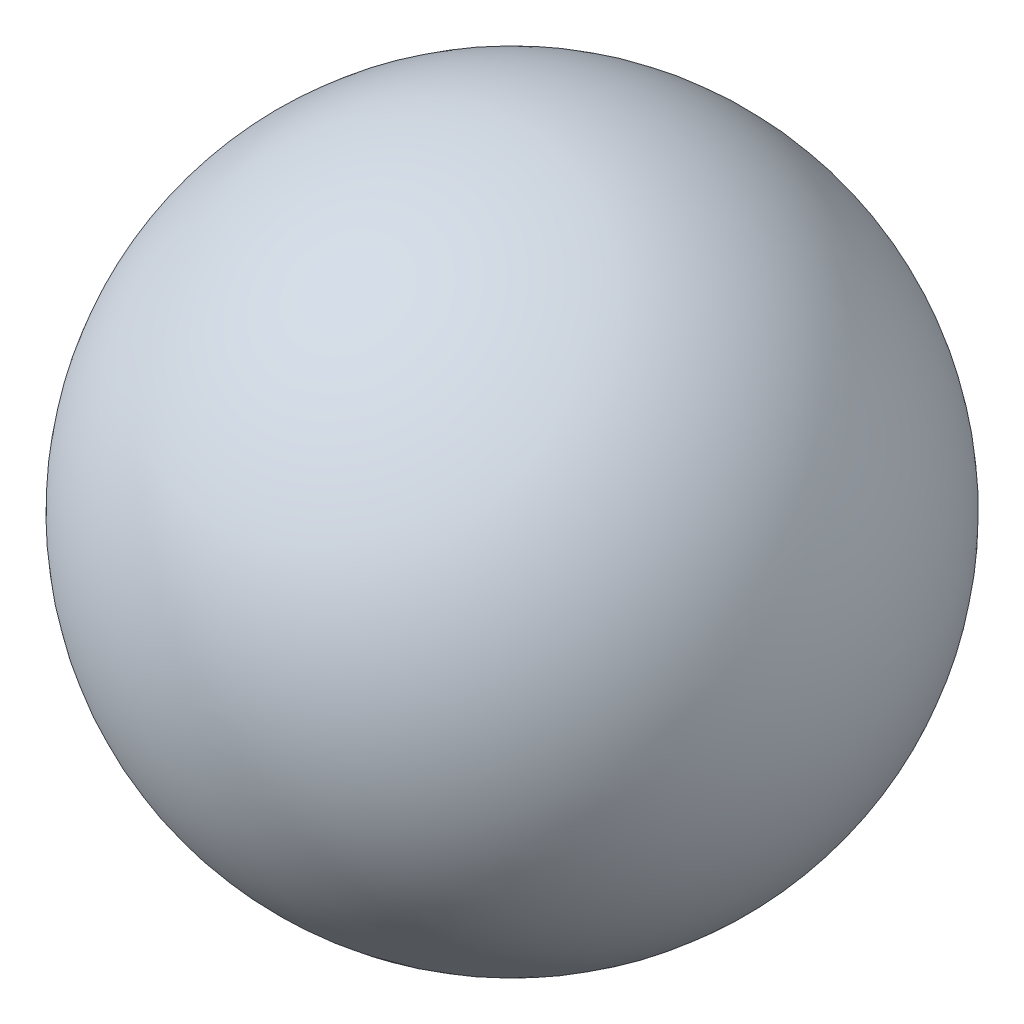
ISO-10303-21;
HEADER;
FILE_DESCRIPTION(('STEP AP214'),'2;1');
FILE_NAME('part.step','',(''),(''),'','','');
FILE_SCHEMA(('AUTOMOTIVE_DESIGN { 1 0 10303 214 1 1 1 1 }'));
ENDSEC;
DATA;
#1=APPLICATION_CONTEXT('core data for automotive mechanical design processes');
#2=APPLICATION_PROTOCOL_DEFINITION('international standard','automotive_design',2000,#1);
#3=PRODUCT_CONTEXT('',#1,'mechanical');
#4=PRODUCT('Part','Part','',(#3));
#5=PRODUCT_RELATED_PRODUCT_CATEGORY('part','',(#4));
#6=PRODUCT_DEFINITION_FORMATION('','',#4);
#7=PRODUCT_DEFINITION_CONTEXT('part definition',#1,'design');
#8=PRODUCT_DEFINITION('design','',#6,#7);
#9=PRODUCT_DEFINITION_SHAPE('','',#8);
#10=(LENGTH_UNIT() NAMED_UNIT(*) SI_UNIT(.MILLI.,.METRE.));
#11=(NAMED_UNIT(*) PLANE_ANGLE_UNIT() SI_UNIT($,.RADIAN.));
#12=(NAMED_UNIT(*) SI_UNIT($,.STERADIAN.) SOLID_ANGLE_UNIT());
#13=UNCERTAINTY_MEASURE_WITH_UNIT(LENGTH_MEASURE(1.E-05),#10,'distance_accuracy_value','');
#14=(GEOMETRIC_REPRESENTATION_CONTEXT(3) GLOBAL_UNCERTAINTY_ASSIGNED_CONTEXT((#13)) GLOBAL_UNIT_ASSIGNED_CONTEXT((#10,
#11,#12)) REPRESENTATION_CONTEXT('',''));
#15=CARTESIAN_POINT('',(0.,0.,0.));
#16=DIRECTION('',(0.,0.,1.));
#17=DIRECTION('',(1.,0.,0.));
#18=AXIS2_PLACEMENT_3D('',#15,#16,#17);
#19=CARTESIAN_POINT('',(67.76,56.3036765773585,40.4842161851037));
#20=DIRECTION('',(0.,0.811906363998105,0.583787680667704));
#21=DIRECTION('',(0.173648177666933,-0.57491863403457,0.799571681985285));
#22=AXIS2_PLACEMENT_3D('',#19,#20,#21);
#23=SPHERICAL_SURFACE('',#22,7.15);
#24=CARTESIAN_POINT('',(67.76,50.4985460747721,36.3101342683296));
#25=VERTEX_POINT('',#24);
#26=VERTEX_LOOP('',#25);
#27=FACE_BOUND('',#26,.T.);
#28=CARTESIAN_POINT('',(67.76,62.108807079945,44.6582981018778));
#29=VERTEX_POINT('',#28);
#30=VERTEX_LOOP('',#29);
#31=FACE_BOUND('',#30,.T.);
#32=ADVANCED_FACE('F16',(#27,#31),#23,.T.);
#33=CLOSED_SHELL('',(#32));
#34=MANIFOLD_SOLID_BREP('B1',#33);
#35=ADVANCED_BREP_SHAPE_REPRESENTATION('',(#18,#34),#14);
#36=SHAPE_DEFINITION_REPRESENTATION(#9,#35);
ENDSEC;
END-ISO-10303-21;
